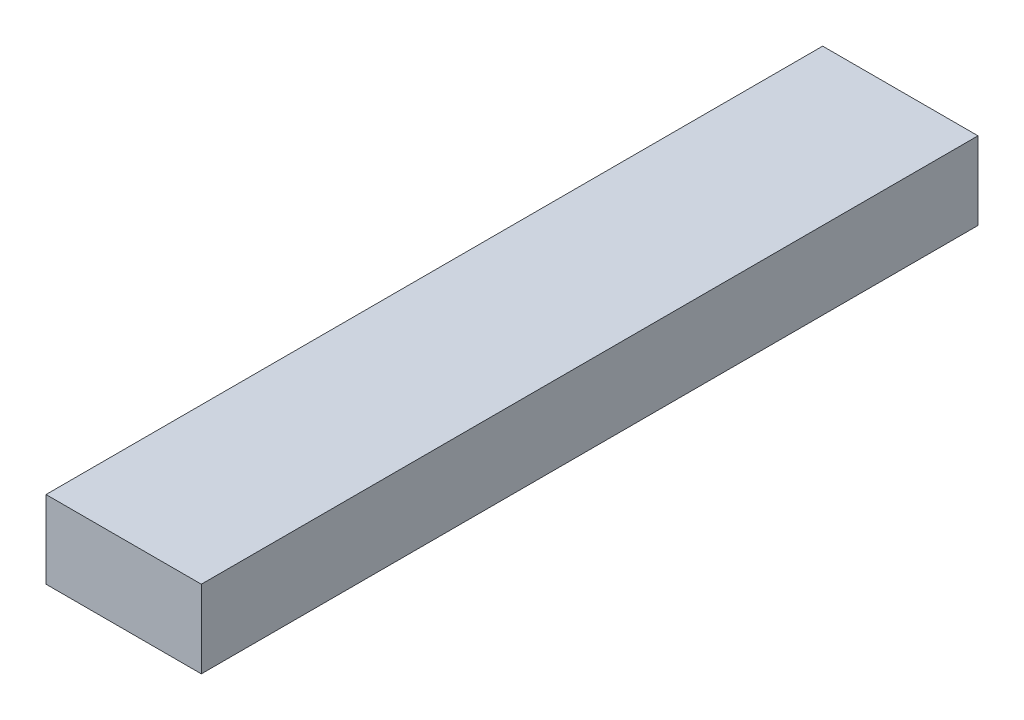
ISO-10303-21;
HEADER;
FILE_DESCRIPTION(('STEP AP214'),'2;1');
FILE_NAME('part.step','',(''),(''),'','','');
FILE_SCHEMA(('AUTOMOTIVE_DESIGN { 1 0 10303 214 1 1 1 1 }'));
ENDSEC;
DATA;
#1=APPLICATION_CONTEXT('core data for automotive mechanical design processes');
#2=APPLICATION_PROTOCOL_DEFINITION('international standard','automotive_design',2000,#1);
#3=PRODUCT_CONTEXT('',#1,'mechanical');
#4=PRODUCT('Part','Part','',(#3));
#5=PRODUCT_RELATED_PRODUCT_CATEGORY('part','',(#4));
#6=PRODUCT_DEFINITION_FORMATION('','',#4);
#7=PRODUCT_DEFINITION_CONTEXT('part definition',#1,'design');
#8=PRODUCT_DEFINITION('design','',#6,#7);
#9=PRODUCT_DEFINITION_SHAPE('','',#8);
#10=(LENGTH_UNIT() NAMED_UNIT(*) SI_UNIT(.MILLI.,.METRE.));
#11=(NAMED_UNIT(*) PLANE_ANGLE_UNIT() SI_UNIT($,.RADIAN.));
#12=(NAMED_UNIT(*) SI_UNIT($,.STERADIAN.) SOLID_ANGLE_UNIT());
#13=UNCERTAINTY_MEASURE_WITH_UNIT(LENGTH_MEASURE(1.E-05),#10,'distance_accuracy_value','');
#14=(GEOMETRIC_REPRESENTATION_CONTEXT(3) GLOBAL_UNCERTAINTY_ASSIGNED_CONTEXT((#13)) GLOBAL_UNIT_ASSIGNED_CONTEXT((#10,
#11,#12)) REPRESENTATION_CONTEXT('',''));
#15=CARTESIAN_POINT('',(0.,0.,0.));
#16=DIRECTION('',(0.,0.,1.));
#17=DIRECTION('',(1.,0.,0.));
#18=AXIS2_PLACEMENT_3D('',#15,#16,#17);
#19=CARTESIAN_POINT('',(-23.9097744360902,22.6315789473684,400.));
#20=DIRECTION('',(1.,0.,0.));
#21=DIRECTION('',(0.,0.,-1.));
#22=AXIS2_PLACEMENT_3D('',#19,#20,#21);
#23=PLANE('',#22);
#24=DIRECTION('',(0.,-1.,0.));
#25=VECTOR('',#24,1.);
#26=CARTESIAN_POINT('',(-23.9097744360902,22.6315789473684,0.));
#27=LINE('',#26,#25);
#28=CARTESIAN_POINT('',(-23.9097744360902,22.6315789473684,0.));
#29=VERTEX_POINT('',#28);
#30=CARTESIAN_POINT('',(-23.9097744360902,-17.3684210526316,0.));
#31=VERTEX_POINT('',#30);
#32=EDGE_CURVE('E95',#29,#31,#27,.T.);
#33=ORIENTED_EDGE('',*,*,#32,.T.);
#34=DIRECTION('',(0.,0.,-1.));
#35=VECTOR('',#34,1.);
#36=CARTESIAN_POINT('',(-23.9097744360902,-17.3684210526316,400.));
#37=LINE('',#36,#35);
#38=CARTESIAN_POINT('',(-23.9097744360902,-17.3684210526316,400.));
#39=VERTEX_POINT('',#38);
#40=EDGE_CURVE('E11',#39,#31,#37,.T.);
#41=ORIENTED_EDGE('',*,*,#40,.F.);
#42=DIRECTION('',(0.,-1.,0.));
#43=VECTOR('',#42,1.);
#44=CARTESIAN_POINT('',(-23.9097744360902,22.6315789473684,400.));
#45=LINE('',#44,#43);
#46=CARTESIAN_POINT('',(-23.9097744360902,22.6315789473684,400.));
#47=VERTEX_POINT('',#46);
#48=EDGE_CURVE('E83',#47,#39,#45,.T.);
#49=ORIENTED_EDGE('',*,*,#48,.F.);
#50=DIRECTION('',(0.,0.,-1.));
#51=VECTOR('',#50,1.);
#52=CARTESIAN_POINT('',(-23.9097744360902,22.6315789473684,400.));
#53=LINE('',#52,#51);
#54=EDGE_CURVE('E91',#47,#29,#53,.T.);
#55=ORIENTED_EDGE('',*,*,#54,.T.);
#56=EDGE_LOOP('',(#33,#41,#49,#55));
#57=FACE_BOUND('',#56,.T.);
#58=ADVANCED_FACE('F32',(#57),#23,.F.);
#59=CARTESIAN_POINT('',(-23.9097744360902,-17.3684210526316,400.));
#60=DIRECTION('',(0.,1.,0.));
#61=DIRECTION('',(0.,0.,1.));
#62=AXIS2_PLACEMENT_3D('',#59,#60,#61);
#63=PLANE('',#62);
#64=DIRECTION('',(1.,0.,0.));
#65=VECTOR('',#64,1.);
#66=CARTESIAN_POINT('',(-23.9097744360902,-17.3684210526316,0.));
#67=LINE('',#66,#65);
#68=CARTESIAN_POINT('',(56.0902255639098,-17.3684210526316,0.));
#69=VERTEX_POINT('',#68);
#70=EDGE_CURVE('E87',#31,#69,#67,.T.);
#71=ORIENTED_EDGE('',*,*,#70,.T.);
#72=DIRECTION('',(0.,0.,-1.));
#73=VECTOR('',#72,1.);
#74=CARTESIAN_POINT('',(56.0902255639098,-17.3684210526316,400.));
#75=LINE('',#74,#73);
#76=CARTESIAN_POINT('',(56.0902255639098,-17.3684210526316,400.));
#77=VERTEX_POINT('',#76);
#78=EDGE_CURVE('E40',#77,#69,#75,.T.);
#79=ORIENTED_EDGE('',*,*,#78,.F.);
#80=DIRECTION('',(1.,0.,0.));
#81=VECTOR('',#80,1.);
#82=CARTESIAN_POINT('',(-23.9097744360902,-17.3684210526316,400.));
#83=LINE('',#82,#81);
#84=EDGE_CURVE('E78',#39,#77,#83,.T.);
#85=ORIENTED_EDGE('',*,*,#84,.F.);
#86=ORIENTED_EDGE('',*,*,#40,.T.);
#87=EDGE_LOOP('',(#71,#79,#85,#86));
#88=FACE_BOUND('',#87,.T.);
#89=ADVANCED_FACE('F86',(#88),#63,.F.);
#90=CARTESIAN_POINT('',(56.0902255639098,22.6315789473684,400.));
#91=DIRECTION('',(-1.,0.,0.));
#92=DIRECTION('',(0.,0.,1.));
#93=AXIS2_PLACEMENT_3D('',#90,#91,#92);
#94=PLANE('',#93);
#95=DIRECTION('',(0.,1.,0.));
#96=VECTOR('',#95,1.);
#97=CARTESIAN_POINT('',(56.0902255639098,22.6315789473684,0.));
#98=LINE('',#97,#96);
#99=CARTESIAN_POINT('',(56.0902255639098,22.6315789473684,0.));
#100=VERTEX_POINT('',#99);
#101=EDGE_CURVE('E65',#69,#100,#98,.T.);
#102=ORIENTED_EDGE('',*,*,#101,.T.);
#103=DIRECTION('',(0.,0.,-1.));
#104=VECTOR('',#103,1.);
#105=CARTESIAN_POINT('',(56.0902255639098,22.6315789473684,400.));
#106=LINE('',#105,#104);
#107=CARTESIAN_POINT('',(56.0902255639098,22.6315789473684,400.));
#108=VERTEX_POINT('',#107);
#109=EDGE_CURVE('E88',#108,#100,#106,.T.);
#110=ORIENTED_EDGE('',*,*,#109,.F.);
#111=DIRECTION('',(0.,1.,0.));
#112=VECTOR('',#111,1.);
#113=CARTESIAN_POINT('',(56.0902255639098,22.6315789473684,400.));
#114=LINE('',#113,#112);
#115=EDGE_CURVE('E81',#77,#108,#114,.T.);
#116=ORIENTED_EDGE('',*,*,#115,.F.);
#117=ORIENTED_EDGE('',*,*,#78,.T.);
#118=EDGE_LOOP('',(#102,#110,#116,#117));
#119=FACE_BOUND('',#118,.T.);
#120=ADVANCED_FACE('F89',(#119),#94,.F.);
#121=CARTESIAN_POINT('',(-23.9097744360902,22.6315789473684,400.));
#122=DIRECTION('',(0.,-1.,0.));
#123=DIRECTION('',(0.,0.,-1.));
#124=AXIS2_PLACEMENT_3D('',#121,#122,#123);
#125=PLANE('',#124);
#126=DIRECTION('',(-1.,0.,0.));
#127=VECTOR('',#126,1.);
#128=CARTESIAN_POINT('',(-23.9097744360902,22.6315789473684,0.));
#129=LINE('',#128,#127);
#130=EDGE_CURVE('E71',#100,#29,#129,.T.);
#131=ORIENTED_EDGE('',*,*,#130,.T.);
#132=ORIENTED_EDGE('',*,*,#54,.F.);
#133=DIRECTION('',(-1.,0.,0.));
#134=VECTOR('',#133,1.);
#135=CARTESIAN_POINT('',(-23.9097744360902,22.6315789473684,400.));
#136=LINE('',#135,#134);
#137=EDGE_CURVE('E48',#108,#47,#136,.T.);
#138=ORIENTED_EDGE('',*,*,#137,.F.);
#139=ORIENTED_EDGE('',*,*,#109,.T.);
#140=EDGE_LOOP('',(#131,#132,#138,#139));
#141=FACE_BOUND('',#140,.T.);
#142=ADVANCED_FACE('F102',(#141),#125,.F.);
#143=CARTESIAN_POINT('',(0.,0.,400.));
#144=DIRECTION('',(0.,0.,1.));
#145=DIRECTION('',(1.,0.,0.));
#146=AXIS2_PLACEMENT_3D('',#143,#144,#145);
#147=PLANE('',#146);
#148=ORIENTED_EDGE('',*,*,#48,.T.);
#149=ORIENTED_EDGE('',*,*,#84,.T.);
#150=ORIENTED_EDGE('',*,*,#115,.T.);
#151=ORIENTED_EDGE('',*,*,#137,.T.);
#152=EDGE_LOOP('',(#148,#149,#150,#151));
#153=FACE_BOUND('',#152,.T.);
#154=ADVANCED_FACE('F79',(#153),#147,.T.);
#155=CARTESIAN_POINT('',(0.,0.,0.));
#156=DIRECTION('',(0.,0.,1.));
#157=DIRECTION('',(1.,0.,0.));
#158=AXIS2_PLACEMENT_3D('',#155,#156,#157);
#159=PLANE('',#158);
#160=ORIENTED_EDGE('',*,*,#32,.F.);
#161=ORIENTED_EDGE('',*,*,#130,.F.);
#162=ORIENTED_EDGE('',*,*,#101,.F.);
#163=ORIENTED_EDGE('',*,*,#70,.F.);
#164=EDGE_LOOP('',(#160,#161,#162,#163));
#165=FACE_BOUND('',#164,.T.);
#166=ADVANCED_FACE('F105',(#165),#159,.F.);
#167=CLOSED_SHELL('',(#58,#89,#120,#142,#154,#166));
#168=MANIFOLD_SOLID_BREP('B2',#167);
#169=ADVANCED_BREP_SHAPE_REPRESENTATION('',(#18,#168),#14);
#170=SHAPE_DEFINITION_REPRESENTATION(#9,#169);
ENDSEC;
END-ISO-10303-21;
